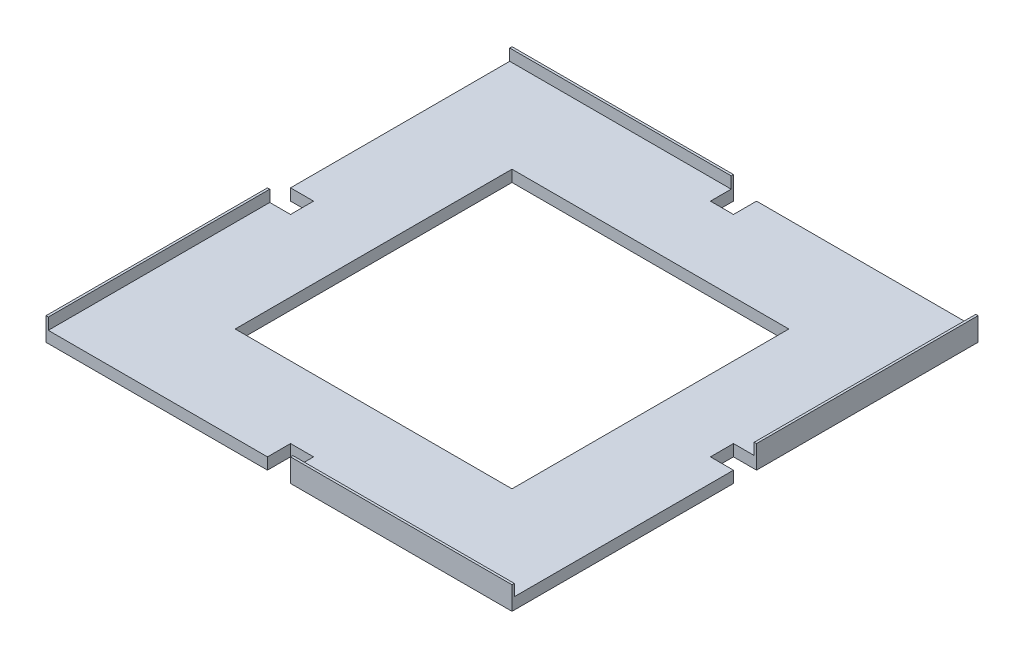
ISO-10303-21;
HEADER;
FILE_DESCRIPTION(('STEP AP214'),'2;1');
FILE_NAME('part.step','',(''),(''),'','','');
FILE_SCHEMA(('AUTOMOTIVE_DESIGN { 1 0 10303 214 1 1 1 1 }'));
ENDSEC;
DATA;
#1=APPLICATION_CONTEXT('core data for automotive mechanical design processes');
#2=APPLICATION_PROTOCOL_DEFINITION('international standard','automotive_design',2000,#1);
#3=PRODUCT_CONTEXT('',#1,'mechanical');
#4=PRODUCT('Part','Part','',(#3));
#5=PRODUCT_RELATED_PRODUCT_CATEGORY('part','',(#4));
#6=PRODUCT_DEFINITION_FORMATION('','',#4);
#7=PRODUCT_DEFINITION_CONTEXT('part definition',#1,'design');
#8=PRODUCT_DEFINITION('design','',#6,#7);
#9=PRODUCT_DEFINITION_SHAPE('','',#8);
#10=(LENGTH_UNIT() NAMED_UNIT(*) SI_UNIT(.MILLI.,.METRE.));
#11=(NAMED_UNIT(*) PLANE_ANGLE_UNIT() SI_UNIT($,.RADIAN.));
#12=(NAMED_UNIT(*) SI_UNIT($,.STERADIAN.) SOLID_ANGLE_UNIT());
#13=UNCERTAINTY_MEASURE_WITH_UNIT(LENGTH_MEASURE(1.E-05),#10,'distance_accuracy_value','');
#14=(GEOMETRIC_REPRESENTATION_CONTEXT(3) GLOBAL_UNCERTAINTY_ASSIGNED_CONTEXT((#13)) GLOBAL_UNIT_ASSIGNED_CONTEXT((#10,
#11,#12)) REPRESENTATION_CONTEXT('',''));
#15=CARTESIAN_POINT('',(0.,0.,0.));
#16=DIRECTION('',(0.,0.,1.));
#17=DIRECTION('',(1.,0.,0.));
#18=AXIS2_PLACEMENT_3D('',#15,#16,#17);
#19=CARTESIAN_POINT('',(0.,5.,0.));
#20=DIRECTION('',(0.,-1.,0.));
#21=DIRECTION('',(0.,0.,-1.));
#22=AXIS2_PLACEMENT_3D('',#19,#20,#21);
#23=PLANE('',#22);
#24=DIRECTION('',(0.,0.,-1.));
#25=VECTOR('',#24,1.);
#26=CARTESIAN_POINT('',(60.,5.,60.));
#27=LINE('',#26,#25);
#28=CARTESIAN_POINT('',(60.,5.,60.));
#29=VERTEX_POINT('',#28);
#30=CARTESIAN_POINT('',(60.,5.,-60.));
#31=VERTEX_POINT('',#30);
#32=EDGE_CURVE('E369',#29,#31,#27,.T.);
#33=ORIENTED_EDGE('',*,*,#32,.F.);
#34=DIRECTION('',(1.,0.,0.));
#35=VECTOR('',#34,1.);
#36=CARTESIAN_POINT('',(-60.,5.,60.));
#37=LINE('',#36,#35);
#38=CARTESIAN_POINT('',(-60.,5.,60.));
#39=VERTEX_POINT('',#38);
#40=EDGE_CURVE('E380',#39,#29,#37,.T.);
#41=ORIENTED_EDGE('',*,*,#40,.F.);
#42=DIRECTION('',(0.,0.,1.));
#43=VECTOR('',#42,1.);
#44=CARTESIAN_POINT('',(-60.,5.,60.));
#45=LINE('',#44,#43);
#46=CARTESIAN_POINT('',(-60.,5.,-60.));
#47=VERTEX_POINT('',#46);
#48=EDGE_CURVE('E376',#47,#39,#45,.T.);
#49=ORIENTED_EDGE('',*,*,#48,.F.);
#50=DIRECTION('',(-1.,0.,0.));
#51=VECTOR('',#50,1.);
#52=CARTESIAN_POINT('',(-60.,5.,-60.));
#53=LINE('',#52,#51);
#54=EDGE_CURVE('E372',#31,#47,#53,.T.);
#55=ORIENTED_EDGE('',*,*,#54,.F.);
#56=EDGE_LOOP('',(#33,#41,#49,#55));
#57=FACE_BOUND('',#56,.T.);
#58=DIRECTION('',(0.,0.,1.));
#59=VECTOR('',#58,1.);
#60=CARTESIAN_POINT('',(100.,5.,-4.99999999999894));
#61=LINE('',#60,#59);
#62=CARTESIAN_POINT('',(100.000000000001,5.,-100.999999999999));
#63=VERTEX_POINT('',#62);
#64=CARTESIAN_POINT('',(100.,5.,-5.));
#65=VERTEX_POINT('',#64);
#66=EDGE_CURVE('E265',#63,#65,#61,.T.);
#67=ORIENTED_EDGE('',*,*,#66,.F.);
#68=DIRECTION('',(-1.,0.,0.));
#69=VECTOR('',#68,1.);
#70=CARTESIAN_POINT('',(101.,5.,-101.));
#71=LINE('',#70,#69);
#72=CARTESIAN_POINT('',(5.00000000000002,5.,-101.));
#73=VERTEX_POINT('',#72);
#74=EDGE_CURVE('E253',#63,#73,#71,.T.);
#75=ORIENTED_EDGE('',*,*,#74,.T.);
#76=DIRECTION('',(0.,0.,1.));
#77=VECTOR('',#76,1.);
#78=CARTESIAN_POINT('',(5.00000000000002,5.,-101.));
#79=LINE('',#78,#77);
#80=CARTESIAN_POINT('',(5.00000000000001,5.,-91.));
#81=VERTEX_POINT('',#80);
#82=EDGE_CURVE('E263',#73,#81,#79,.T.);
#83=ORIENTED_EDGE('',*,*,#82,.T.);
#84=DIRECTION('',(-1.,0.,0.));
#85=VECTOR('',#84,1.);
#86=CARTESIAN_POINT('',(-5.,5.,-91.));
#87=LINE('',#86,#85);
#88=CARTESIAN_POINT('',(-5.,5.,-91.));
#89=VERTEX_POINT('',#88);
#90=EDGE_CURVE('E450',#81,#89,#87,.T.);
#91=ORIENTED_EDGE('',*,*,#90,.T.);
#92=DIRECTION('',(0.,0.,-1.));
#93=VECTOR('',#92,1.);
#94=CARTESIAN_POINT('',(-4.99999999999999,5.,-101.));
#95=LINE('',#94,#93);
#96=CARTESIAN_POINT('',(-4.99999999999999,5.,-100.));
#97=VERTEX_POINT('',#96);
#98=EDGE_CURVE('E453',#89,#97,#95,.T.);
#99=ORIENTED_EDGE('',*,*,#98,.T.);
#100=DIRECTION('',(1.,0.,0.));
#101=VECTOR('',#100,1.);
#102=CARTESIAN_POINT('',(-4.99999999999929,5.,-100.));
#103=LINE('',#102,#101);
#104=CARTESIAN_POINT('',(-101.,5.,-100.));
#105=VERTEX_POINT('',#104);
#106=EDGE_CURVE('E66',#105,#97,#103,.T.);
#107=ORIENTED_EDGE('',*,*,#106,.F.);
#108=DIRECTION('',(0.,0.,1.));
#109=VECTOR('',#108,1.);
#110=CARTESIAN_POINT('',(-101.,5.,-5.));
#111=LINE('',#110,#109);
#112=CARTESIAN_POINT('',(-101.,5.,-5.));
#113=VERTEX_POINT('',#112);
#114=EDGE_CURVE('E412',#105,#113,#111,.T.);
#115=ORIENTED_EDGE('',*,*,#114,.T.);
#116=DIRECTION('',(1.,0.,0.));
#117=VECTOR('',#116,1.);
#118=CARTESIAN_POINT('',(-101.,5.,-5.));
#119=LINE('',#118,#117);
#120=CARTESIAN_POINT('',(-90.9999999999999,5.,-5.00000000000001));
#121=VERTEX_POINT('',#120);
#122=EDGE_CURVE('E415',#113,#121,#119,.T.);
#123=ORIENTED_EDGE('',*,*,#122,.T.);
#124=DIRECTION('',(0.,0.,1.));
#125=VECTOR('',#124,1.);
#126=CARTESIAN_POINT('',(-91.,5.,5.00000000000001));
#127=LINE('',#126,#125);
#128=CARTESIAN_POINT('',(-91.,5.,5.00000000000001));
#129=VERTEX_POINT('',#128);
#130=EDGE_CURVE('E419',#121,#129,#127,.T.);
#131=ORIENTED_EDGE('',*,*,#130,.T.);
#132=DIRECTION('',(-1.,0.,0.));
#133=VECTOR('',#132,1.);
#134=CARTESIAN_POINT('',(-101.,5.,5.));
#135=LINE('',#134,#133);
#136=CARTESIAN_POINT('',(-100.,5.,5.));
#137=VERTEX_POINT('',#136);
#138=EDGE_CURVE('E422',#129,#137,#135,.T.);
#139=ORIENTED_EDGE('',*,*,#138,.T.);
#140=DIRECTION('',(0.,0.,-1.));
#141=VECTOR('',#140,1.);
#142=CARTESIAN_POINT('',(-100.,5.,4.99999999999964));
#143=LINE('',#142,#141);
#144=CARTESIAN_POINT('',(-100.,5.,101.));
#145=VERTEX_POINT('',#144);
#146=EDGE_CURVE('E325',#145,#137,#143,.T.);
#147=ORIENTED_EDGE('',*,*,#146,.F.);
#148=DIRECTION('',(1.,0.,0.));
#149=VECTOR('',#148,1.);
#150=CARTESIAN_POINT('',(-5.00000000000001,5.,101.));
#151=LINE('',#150,#149);
#152=CARTESIAN_POINT('',(-5.00000000000001,5.,101.));
#153=VERTEX_POINT('',#152);
#154=EDGE_CURVE('E425',#145,#153,#151,.T.);
#155=ORIENTED_EDGE('',*,*,#154,.T.);
#156=DIRECTION('',(0.,0.,-1.));
#157=VECTOR('',#156,1.);
#158=CARTESIAN_POINT('',(-5.00000000000001,5.,101.));
#159=LINE('',#158,#157);
#160=CARTESIAN_POINT('',(-4.99999999999998,5.,91.));
#161=VERTEX_POINT('',#160);
#162=EDGE_CURVE('E428',#153,#161,#159,.T.);
#163=ORIENTED_EDGE('',*,*,#162,.T.);
#164=DIRECTION('',(1.,0.,0.));
#165=VECTOR('',#164,1.);
#166=CARTESIAN_POINT('',(5.00000000000003,5.,91.));
#167=LINE('',#166,#165);
#168=CARTESIAN_POINT('',(5.00000000000003,5.,91.));
#169=VERTEX_POINT('',#168);
#170=EDGE_CURVE('E431',#161,#169,#167,.T.);
#171=ORIENTED_EDGE('',*,*,#170,.T.);
#172=DIRECTION('',(0.,0.,1.));
#173=VECTOR('',#172,1.);
#174=CARTESIAN_POINT('',(4.99999999999999,5.,101.));
#175=LINE('',#174,#173);
#176=CARTESIAN_POINT('',(4.99999999999999,5.,100.));
#177=VERTEX_POINT('',#176);
#178=EDGE_CURVE('E434',#169,#177,#175,.T.);
#179=ORIENTED_EDGE('',*,*,#178,.T.);
#180=DIRECTION('',(-1.,0.,0.));
#181=VECTOR('',#180,1.);
#182=CARTESIAN_POINT('',(4.99999999999999,5.,100.));
#183=LINE('',#182,#181);
#184=CARTESIAN_POINT('',(101.,5.,100.));
#185=VERTEX_POINT('',#184);
#186=EDGE_CURVE('E329',#185,#177,#183,.T.);
#187=ORIENTED_EDGE('',*,*,#186,.F.);
#188=DIRECTION('',(0.,0.,-1.));
#189=VECTOR('',#188,1.);
#190=CARTESIAN_POINT('',(101.,5.,101.));
#191=LINE('',#190,#189);
#192=CARTESIAN_POINT('',(101.,5.,5.));
#193=VERTEX_POINT('',#192);
#194=EDGE_CURVE('E437',#185,#193,#191,.T.);
#195=ORIENTED_EDGE('',*,*,#194,.T.);
#196=DIRECTION('',(-1.,0.,0.));
#197=VECTOR('',#196,1.);
#198=CARTESIAN_POINT('',(101.,5.,5.));
#199=LINE('',#198,#197);
#200=CARTESIAN_POINT('',(91.,5.,5.00000000000001));
#201=VERTEX_POINT('',#200);
#202=EDGE_CURVE('E440',#193,#201,#199,.T.);
#203=ORIENTED_EDGE('',*,*,#202,.T.);
#204=DIRECTION('',(0.,0.,-1.));
#205=VECTOR('',#204,1.);
#206=CARTESIAN_POINT('',(91.,5.,-4.99999999999999));
#207=LINE('',#206,#205);
#208=CARTESIAN_POINT('',(91.,5.,-4.99999999999999));
#209=VERTEX_POINT('',#208);
#210=EDGE_CURVE('E443',#201,#209,#207,.T.);
#211=ORIENTED_EDGE('',*,*,#210,.T.);
#212=DIRECTION('',(1.,0.,0.));
#213=VECTOR('',#212,1.);
#214=CARTESIAN_POINT('',(101.,5.,-5.));
#215=LINE('',#214,#213);
#216=EDGE_CURVE('E59',#209,#65,#215,.T.);
#217=ORIENTED_EDGE('',*,*,#216,.T.);
#218=EDGE_LOOP('',(#67,#75,#83,#91,#99,#107,#115,#123,#131,#139,#147,#155,#163,#171,#179,#187,
#195,#203,#211,#217));
#219=FACE_BOUND('',#218,.T.);
#220=ADVANCED_FACE('F43',(#57,#219),#23,.F.);
#221=CARTESIAN_POINT('',(0.,0.,0.));
#222=DIRECTION('',(0.,-1.,0.));
#223=DIRECTION('',(0.,0.,-1.));
#224=AXIS2_PLACEMENT_3D('',#221,#222,#223);
#225=PLANE('',#224);
#226=DIRECTION('',(-1.,0.,0.));
#227=VECTOR('',#226,1.);
#228=CARTESIAN_POINT('',(-4.99999999999999,0.,-101.));
#229=LINE('',#228,#227);
#230=CARTESIAN_POINT('',(-4.99999999999999,0.,-101.));
#231=VERTEX_POINT('',#230);
#232=CARTESIAN_POINT('',(-101.,0.,-101.));
#233=VERTEX_POINT('',#232);
#234=EDGE_CURVE('E411',#231,#233,#229,.T.);
#235=ORIENTED_EDGE('',*,*,#234,.F.);
#236=DIRECTION('',(0.,0.,-1.));
#237=VECTOR('',#236,1.);
#238=CARTESIAN_POINT('',(-4.99999999999999,0.,-101.));
#239=LINE('',#238,#237);
#240=CARTESIAN_POINT('',(-5.,0.,-91.));
#241=VERTEX_POINT('',#240);
#242=EDGE_CURVE('E416',#241,#231,#239,.T.);
#243=ORIENTED_EDGE('',*,*,#242,.F.);
#244=DIRECTION('',(-1.,0.,0.));
#245=VECTOR('',#244,1.);
#246=CARTESIAN_POINT('',(-5.,0.,-91.));
#247=LINE('',#246,#245);
#248=CARTESIAN_POINT('',(5.00000000000001,0.,-91.));
#249=VERTEX_POINT('',#248);
#250=EDGE_CURVE('E511',#249,#241,#247,.T.);
#251=ORIENTED_EDGE('',*,*,#250,.F.);
#252=DIRECTION('',(0.,0.,1.));
#253=VECTOR('',#252,1.);
#254=CARTESIAN_POINT('',(5.00000000000002,0.,-101.));
#255=LINE('',#254,#253);
#256=CARTESIAN_POINT('',(5.00000000000002,0.,-101.));
#257=VERTEX_POINT('',#256);
#258=EDGE_CURVE('E508',#257,#249,#255,.T.);
#259=ORIENTED_EDGE('',*,*,#258,.F.);
#260=DIRECTION('',(-1.,0.,0.));
#261=VECTOR('',#260,1.);
#262=CARTESIAN_POINT('',(101.,0.,-101.));
#263=LINE('',#262,#261);
#264=CARTESIAN_POINT('',(101.,0.,-101.));
#265=VERTEX_POINT('',#264);
#266=EDGE_CURVE('E505',#265,#257,#263,.T.);
#267=ORIENTED_EDGE('',*,*,#266,.F.);
#268=DIRECTION('',(0.,0.,-1.));
#269=VECTOR('',#268,1.);
#270=CARTESIAN_POINT('',(101.,0.,-5.));
#271=LINE('',#270,#269);
#272=CARTESIAN_POINT('',(101.,0.,-5.));
#273=VERTEX_POINT('',#272);
#274=EDGE_CURVE('E502',#273,#265,#271,.T.);
#275=ORIENTED_EDGE('',*,*,#274,.F.);
#276=DIRECTION('',(1.,0.,0.));
#277=VECTOR('',#276,1.);
#278=CARTESIAN_POINT('',(101.,0.,-5.));
#279=LINE('',#278,#277);
#280=CARTESIAN_POINT('',(91.,0.,-4.99999999999999));
#281=VERTEX_POINT('',#280);
#282=EDGE_CURVE('E499',#281,#273,#279,.T.);
#283=ORIENTED_EDGE('',*,*,#282,.F.);
#284=DIRECTION('',(0.,0.,-1.));
#285=VECTOR('',#284,1.);
#286=CARTESIAN_POINT('',(91.,0.,-4.99999999999999));
#287=LINE('',#286,#285);
#288=CARTESIAN_POINT('',(91.,0.,5.00000000000001));
#289=VERTEX_POINT('',#288);
#290=EDGE_CURVE('E496',#289,#281,#287,.T.);
#291=ORIENTED_EDGE('',*,*,#290,.F.);
#292=DIRECTION('',(-1.,0.,0.));
#293=VECTOR('',#292,1.);
#294=CARTESIAN_POINT('',(101.,0.,5.));
#295=LINE('',#294,#293);
#296=CARTESIAN_POINT('',(101.,0.,5.));
#297=VERTEX_POINT('',#296);
#298=EDGE_CURVE('E493',#297,#289,#295,.T.);
#299=ORIENTED_EDGE('',*,*,#298,.F.);
#300=DIRECTION('',(0.,0.,-1.));
#301=VECTOR('',#300,1.);
#302=CARTESIAN_POINT('',(101.,0.,101.));
#303=LINE('',#302,#301);
#304=CARTESIAN_POINT('',(101.,0.,101.));
#305=VERTEX_POINT('',#304);
#306=EDGE_CURVE('E490',#305,#297,#303,.T.);
#307=ORIENTED_EDGE('',*,*,#306,.F.);
#308=DIRECTION('',(1.,0.,0.));
#309=VECTOR('',#308,1.);
#310=CARTESIAN_POINT('',(101.,0.,101.));
#311=LINE('',#310,#309);
#312=CARTESIAN_POINT('',(4.99999999999999,0.,101.));
#313=VERTEX_POINT('',#312);
#314=EDGE_CURVE('E487',#313,#305,#311,.T.);
#315=ORIENTED_EDGE('',*,*,#314,.F.);
#316=DIRECTION('',(0.,0.,1.));
#317=VECTOR('',#316,1.);
#318=CARTESIAN_POINT('',(4.99999999999999,0.,101.));
#319=LINE('',#318,#317);
#320=CARTESIAN_POINT('',(5.00000000000003,0.,91.));
#321=VERTEX_POINT('',#320);
#322=EDGE_CURVE('E484',#321,#313,#319,.T.);
#323=ORIENTED_EDGE('',*,*,#322,.F.);
#324=DIRECTION('',(1.,0.,0.));
#325=VECTOR('',#324,1.);
#326=CARTESIAN_POINT('',(5.00000000000003,0.,91.));
#327=LINE('',#326,#325);
#328=CARTESIAN_POINT('',(-4.99999999999998,0.,91.));
#329=VERTEX_POINT('',#328);
#330=EDGE_CURVE('E481',#329,#321,#327,.T.);
#331=ORIENTED_EDGE('',*,*,#330,.F.);
#332=DIRECTION('',(0.,0.,-1.));
#333=VECTOR('',#332,1.);
#334=CARTESIAN_POINT('',(-5.00000000000001,0.,101.));
#335=LINE('',#334,#333);
#336=CARTESIAN_POINT('',(-5.00000000000001,0.,101.));
#337=VERTEX_POINT('',#336);
#338=EDGE_CURVE('E478',#337,#329,#335,.T.);
#339=ORIENTED_EDGE('',*,*,#338,.F.);
#340=DIRECTION('',(1.,0.,0.));
#341=VECTOR('',#340,1.);
#342=CARTESIAN_POINT('',(-5.00000000000001,0.,101.));
#343=LINE('',#342,#341);
#344=CARTESIAN_POINT('',(-101.,0.,101.));
#345=VERTEX_POINT('',#344);
#346=EDGE_CURVE('E475',#345,#337,#343,.T.);
#347=ORIENTED_EDGE('',*,*,#346,.F.);
#348=DIRECTION('',(0.,0.,1.));
#349=VECTOR('',#348,1.);
#350=CARTESIAN_POINT('',(-101.,0.,101.));
#351=LINE('',#350,#349);
#352=CARTESIAN_POINT('',(-101.,0.,5.));
#353=VERTEX_POINT('',#352);
#354=EDGE_CURVE('E472',#353,#345,#351,.T.);
#355=ORIENTED_EDGE('',*,*,#354,.F.);
#356=DIRECTION('',(-1.,0.,0.));
#357=VECTOR('',#356,1.);
#358=CARTESIAN_POINT('',(-101.,0.,5.));
#359=LINE('',#358,#357);
#360=CARTESIAN_POINT('',(-91.,0.,5.00000000000001));
#361=VERTEX_POINT('',#360);
#362=EDGE_CURVE('E469',#361,#353,#359,.T.);
#363=ORIENTED_EDGE('',*,*,#362,.F.);
#364=DIRECTION('',(0.,0.,1.));
#365=VECTOR('',#364,1.);
#366=CARTESIAN_POINT('',(-91.,0.,5.00000000000001));
#367=LINE('',#366,#365);
#368=CARTESIAN_POINT('',(-90.9999999999999,0.,-5.00000000000001));
#369=VERTEX_POINT('',#368);
#370=EDGE_CURVE('E466',#369,#361,#367,.T.);
#371=ORIENTED_EDGE('',*,*,#370,.F.);
#372=DIRECTION('',(1.,0.,0.));
#373=VECTOR('',#372,1.);
#374=CARTESIAN_POINT('',(-101.,0.,-5.));
#375=LINE('',#374,#373);
#376=CARTESIAN_POINT('',(-101.,0.,-5.));
#377=VERTEX_POINT('',#376);
#378=EDGE_CURVE('E463',#377,#369,#375,.T.);
#379=ORIENTED_EDGE('',*,*,#378,.F.);
#380=DIRECTION('',(0.,0.,1.));
#381=VECTOR('',#380,1.);
#382=CARTESIAN_POINT('',(-101.,0.,-5.));
#383=LINE('',#382,#381);
#384=EDGE_CURVE('E460',#233,#377,#383,.T.);
#385=ORIENTED_EDGE('',*,*,#384,.F.);
#386=EDGE_LOOP('',(#235,#243,#251,#259,#267,#275,#283,#291,#299,#307,#315,#323,#331,#339,#347,
#355,#363,#371,#379,#385));
#387=FACE_BOUND('',#386,.T.);
#388=DIRECTION('',(1.,0.,0.));
#389=VECTOR('',#388,1.);
#390=CARTESIAN_POINT('',(-60.,0.,60.));
#391=LINE('',#390,#389);
#392=CARTESIAN_POINT('',(-60.,0.,60.));
#393=VERTEX_POINT('',#392);
#394=CARTESIAN_POINT('',(60.,0.,60.));
#395=VERTEX_POINT('',#394);
#396=EDGE_CURVE('E373',#393,#395,#391,.T.);
#397=ORIENTED_EDGE('',*,*,#396,.T.);
#398=DIRECTION('',(0.,0.,-1.));
#399=VECTOR('',#398,1.);
#400=CARTESIAN_POINT('',(60.,0.,60.));
#401=LINE('',#400,#399);
#402=CARTESIAN_POINT('',(60.,0.,-60.));
#403=VERTEX_POINT('',#402);
#404=EDGE_CURVE('E368',#395,#403,#401,.T.);
#405=ORIENTED_EDGE('',*,*,#404,.T.);
#406=DIRECTION('',(-1.,0.,0.));
#407=VECTOR('',#406,1.);
#408=CARTESIAN_POINT('',(-60.,0.,-60.));
#409=LINE('',#408,#407);
#410=CARTESIAN_POINT('',(-60.,0.,-60.));
#411=VERTEX_POINT('',#410);
#412=EDGE_CURVE('E387',#403,#411,#409,.T.);
#413=ORIENTED_EDGE('',*,*,#412,.T.);
#414=DIRECTION('',(0.,0.,1.));
#415=VECTOR('',#414,1.);
#416=CARTESIAN_POINT('',(-60.,0.,60.));
#417=LINE('',#416,#415);
#418=EDGE_CURVE('E391',#411,#393,#417,.T.);
#419=ORIENTED_EDGE('',*,*,#418,.T.);
#420=EDGE_LOOP('',(#397,#405,#413,#419));
#421=FACE_BOUND('',#420,.T.);
#422=ADVANCED_FACE('F596',(#387,#421),#225,.T.);
#423=CARTESIAN_POINT('',(-4.99999999999999,5.,-101.));
#424=DIRECTION('',(0.,0.,1.));
#425=DIRECTION('',(1.,0.,0.));
#426=AXIS2_PLACEMENT_3D('',#423,#424,#425);
#427=PLANE('',#426);
#428=ORIENTED_EDGE('',*,*,#234,.T.);
#429=DIRECTION('',(0.,-1.,0.));
#430=VECTOR('',#429,1.);
#431=CARTESIAN_POINT('',(-101.,5.,-101.));
#432=LINE('',#431,#430);
#433=CARTESIAN_POINT('',(-100.999999999999,10.,-101.000000000001));
#434=VERTEX_POINT('',#433);
#435=EDGE_CURVE('E11',#434,#233,#432,.T.);
#436=ORIENTED_EDGE('',*,*,#435,.F.);
#437=DIRECTION('',(-1.,0.,0.));
#438=VECTOR('',#437,1.);
#439=CARTESIAN_POINT('',(-4.99999999999929,10.,-101.));
#440=LINE('',#439,#438);
#441=CARTESIAN_POINT('',(-4.99999999999929,10.,-101.));
#442=VERTEX_POINT('',#441);
#443=EDGE_CURVE('E304',#442,#434,#440,.T.);
#444=ORIENTED_EDGE('',*,*,#443,.F.);
#445=DIRECTION('',(0.,-1.,0.));
#446=VECTOR('',#445,1.);
#447=CARTESIAN_POINT('',(-4.99999999999999,5.,-101.));
#448=LINE('',#447,#446);
#449=EDGE_CURVE('E456',#442,#231,#448,.T.);
#450=ORIENTED_EDGE('',*,*,#449,.T.);
#451=EDGE_LOOP('',(#428,#436,#444,#450));
#452=FACE_BOUND('',#451,.T.);
#453=ADVANCED_FACE('F45',(#452),#427,.F.);
#454=CARTESIAN_POINT('',(-101.,5.,-5.));
#455=DIRECTION('',(1.,0.,0.));
#456=DIRECTION('',(0.,0.,-1.));
#457=AXIS2_PLACEMENT_3D('',#454,#455,#456);
#458=PLANE('',#457);
#459=ORIENTED_EDGE('',*,*,#384,.T.);
#460=DIRECTION('',(0.,-1.,0.));
#461=VECTOR('',#460,1.);
#462=CARTESIAN_POINT('',(-101.,5.,-5.));
#463=LINE('',#462,#461);
#464=EDGE_CURVE('E52',#113,#377,#463,.T.);
#465=ORIENTED_EDGE('',*,*,#464,.F.);
#466=ORIENTED_EDGE('',*,*,#114,.F.);
#467=DIRECTION('',(0.,-1.,0.));
#468=VECTOR('',#467,1.);
#469=CARTESIAN_POINT('',(-100.999999999999,10.,-100.000000000001));
#470=LINE('',#469,#468);
#471=CARTESIAN_POINT('',(-100.999999999999,10.,-100.000000000001));
#472=VERTEX_POINT('',#471);
#473=EDGE_CURVE('E270',#472,#105,#470,.T.);
#474=ORIENTED_EDGE('',*,*,#473,.F.);
#475=DIRECTION('',(0.,0.,1.));
#476=VECTOR('',#475,1.);
#477=CARTESIAN_POINT('',(-100.999999999999,10.,-101.000000000001));
#478=LINE('',#477,#476);
#479=EDGE_CURVE('E311',#434,#472,#478,.T.);
#480=ORIENTED_EDGE('',*,*,#479,.F.);
#481=ORIENTED_EDGE('',*,*,#435,.T.);
#482=EDGE_LOOP('',(#459,#465,#466,#474,#480,#481));
#483=FACE_BOUND('',#482,.T.);
#484=ADVANCED_FACE('F688',(#483),#458,.F.);
#485=CARTESIAN_POINT('',(-101.,5.,-5.));
#486=DIRECTION('',(0.,0.,-1.));
#487=DIRECTION('',(-1.,0.,0.));
#488=AXIS2_PLACEMENT_3D('',#485,#486,#487);
#489=PLANE('',#488);
#490=ORIENTED_EDGE('',*,*,#378,.T.);
#491=DIRECTION('',(0.,-1.,0.));
#492=VECTOR('',#491,1.);
#493=CARTESIAN_POINT('',(-90.9999999999999,5.,-5.00000000000001));
#494=LINE('',#493,#492);
#495=EDGE_CURVE('E581',#121,#369,#494,.T.);
#496=ORIENTED_EDGE('',*,*,#495,.F.);
#497=ORIENTED_EDGE('',*,*,#122,.F.);
#498=ORIENTED_EDGE('',*,*,#464,.T.);
#499=EDGE_LOOP('',(#490,#496,#497,#498));
#500=FACE_BOUND('',#499,.T.);
#501=ADVANCED_FACE('F590',(#500),#489,.F.);
#502=CARTESIAN_POINT('',(-91.,5.,5.00000000000001));
#503=DIRECTION('',(1.,0.,0.));
#504=DIRECTION('',(0.,0.,-1.));
#505=AXIS2_PLACEMENT_3D('',#502,#503,#504);
#506=PLANE('',#505);
#507=ORIENTED_EDGE('',*,*,#370,.T.);
#508=DIRECTION('',(0.,-1.,0.));
#509=VECTOR('',#508,1.);
#510=CARTESIAN_POINT('',(-91.,5.,5.00000000000001));
#511=LINE('',#510,#509);
#512=EDGE_CURVE('E577',#129,#361,#511,.T.);
#513=ORIENTED_EDGE('',*,*,#512,.F.);
#514=ORIENTED_EDGE('',*,*,#130,.F.);
#515=ORIENTED_EDGE('',*,*,#495,.T.);
#516=EDGE_LOOP('',(#507,#513,#514,#515));
#517=FACE_BOUND('',#516,.T.);
#518=ADVANCED_FACE('F602',(#517),#506,.F.);
#519=CARTESIAN_POINT('',(-101.,5.,5.));
#520=DIRECTION('',(0.,0.,1.));
#521=DIRECTION('',(1.,0.,0.));
#522=AXIS2_PLACEMENT_3D('',#519,#520,#521);
#523=PLANE('',#522);
#524=ORIENTED_EDGE('',*,*,#362,.T.);
#525=DIRECTION('',(0.,-1.,0.));
#526=VECTOR('',#525,1.);
#527=CARTESIAN_POINT('',(-101.,5.,5.));
#528=LINE('',#527,#526);
#529=CARTESIAN_POINT('',(-101.,10.,4.99999999999964));
#530=VERTEX_POINT('',#529);
#531=EDGE_CURVE('E573',#530,#353,#528,.T.);
#532=ORIENTED_EDGE('',*,*,#531,.F.);
#533=DIRECTION('',(-1.,0.,0.));
#534=VECTOR('',#533,1.);
#535=CARTESIAN_POINT('',(-101.,10.,4.99999999999964));
#536=LINE('',#535,#534);
#537=CARTESIAN_POINT('',(-100.,10.,4.99999999999964));
#538=VERTEX_POINT('',#537);
#539=EDGE_CURVE('E324',#538,#530,#536,.T.);
#540=ORIENTED_EDGE('',*,*,#539,.F.);
#541=DIRECTION('',(0.,-1.,0.));
#542=VECTOR('',#541,1.);
#543=CARTESIAN_POINT('',(-100.,10.,4.99999999999964));
#544=LINE('',#543,#542);
#545=EDGE_CURVE('E320',#538,#137,#544,.T.);
#546=ORIENTED_EDGE('',*,*,#545,.T.);
#547=ORIENTED_EDGE('',*,*,#138,.F.);
#548=ORIENTED_EDGE('',*,*,#512,.T.);
#549=EDGE_LOOP('',(#524,#532,#540,#546,#547,#548));
#550=FACE_BOUND('',#549,.T.);
#551=ADVANCED_FACE('F606',(#550),#523,.F.);
#552=CARTESIAN_POINT('',(-101.,5.,101.));
#553=DIRECTION('',(1.,0.,0.));
#554=DIRECTION('',(0.,0.,-1.));
#555=AXIS2_PLACEMENT_3D('',#552,#553,#554);
#556=PLANE('',#555);
#557=ORIENTED_EDGE('',*,*,#354,.T.);
#558=DIRECTION('',(0.,-1.,0.));
#559=VECTOR('',#558,1.);
#560=CARTESIAN_POINT('',(-101.,5.,101.));
#561=LINE('',#560,#559);
#562=CARTESIAN_POINT('',(-101.,10.,101.));
#563=VERTEX_POINT('',#562);
#564=EDGE_CURVE('E569',#563,#345,#561,.T.);
#565=ORIENTED_EDGE('',*,*,#564,.F.);
#566=DIRECTION('',(0.,0.,1.));
#567=VECTOR('',#566,1.);
#568=CARTESIAN_POINT('',(-101.,10.,4.99999999999964));
#569=LINE('',#568,#567);
#570=EDGE_CURVE('E330',#530,#563,#569,.T.);
#571=ORIENTED_EDGE('',*,*,#570,.F.);
#572=ORIENTED_EDGE('',*,*,#531,.T.);
#573=EDGE_LOOP('',(#557,#565,#571,#572));
#574=FACE_BOUND('',#573,.T.);
#575=ADVANCED_FACE('F737',(#574),#556,.F.);
#576=CARTESIAN_POINT('',(-5.00000000000001,5.,101.));
#577=DIRECTION('',(0.,0.,-1.));
#578=DIRECTION('',(-1.,0.,0.));
#579=AXIS2_PLACEMENT_3D('',#576,#577,#578);
#580=PLANE('',#579);
#581=ORIENTED_EDGE('',*,*,#346,.T.);
#582=DIRECTION('',(0.,-1.,0.));
#583=VECTOR('',#582,1.);
#584=CARTESIAN_POINT('',(-5.00000000000001,5.,101.));
#585=LINE('',#584,#583);
#586=EDGE_CURVE('E565',#153,#337,#585,.T.);
#587=ORIENTED_EDGE('',*,*,#586,.F.);
#588=ORIENTED_EDGE('',*,*,#154,.F.);
#589=DIRECTION('',(0.,-1.,0.));
#590=VECTOR('',#589,1.);
#591=CARTESIAN_POINT('',(-100.,10.,101.));
#592=LINE('',#591,#590);
#593=CARTESIAN_POINT('',(-100.,10.,101.));
#594=VERTEX_POINT('',#593);
#595=EDGE_CURVE('E303',#594,#145,#592,.T.);
#596=ORIENTED_EDGE('',*,*,#595,.F.);
#597=DIRECTION('',(1.,0.,0.));
#598=VECTOR('',#597,1.);
#599=CARTESIAN_POINT('',(-101.,10.,101.));
#600=LINE('',#599,#598);
#601=EDGE_CURVE('E337',#563,#594,#600,.T.);
#602=ORIENTED_EDGE('',*,*,#601,.F.);
#603=ORIENTED_EDGE('',*,*,#564,.T.);
#604=EDGE_LOOP('',(#581,#587,#588,#596,#602,#603));
#605=FACE_BOUND('',#604,.T.);
#606=ADVANCED_FACE('F616',(#605),#580,.F.);
#607=CARTESIAN_POINT('',(-5.00000000000001,5.,101.));
#608=DIRECTION('',(-1.,0.,0.));
#609=DIRECTION('',(0.,0.,1.));
#610=AXIS2_PLACEMENT_3D('',#607,#608,#609);
#611=PLANE('',#610);
#612=ORIENTED_EDGE('',*,*,#338,.T.);
#613=DIRECTION('',(0.,-1.,0.));
#614=VECTOR('',#613,1.);
#615=CARTESIAN_POINT('',(-4.99999999999998,5.,91.));
#616=LINE('',#615,#614);
#617=EDGE_CURVE('E561',#161,#329,#616,.T.);
#618=ORIENTED_EDGE('',*,*,#617,.F.);
#619=ORIENTED_EDGE('',*,*,#162,.F.);
#620=ORIENTED_EDGE('',*,*,#586,.T.);
#621=EDGE_LOOP('',(#612,#618,#619,#620));
#622=FACE_BOUND('',#621,.T.);
#623=ADVANCED_FACE('F623',(#622),#611,.F.);
#624=CARTESIAN_POINT('',(5.00000000000003,5.,91.));
#625=DIRECTION('',(0.,0.,-1.));
#626=DIRECTION('',(-1.,0.,0.));
#627=AXIS2_PLACEMENT_3D('',#624,#625,#626);
#628=PLANE('',#627);
#629=ORIENTED_EDGE('',*,*,#330,.T.);
#630=DIRECTION('',(0.,-1.,0.));
#631=VECTOR('',#630,1.);
#632=CARTESIAN_POINT('',(5.00000000000003,5.,91.));
#633=LINE('',#632,#631);
#634=EDGE_CURVE('E557',#169,#321,#633,.T.);
#635=ORIENTED_EDGE('',*,*,#634,.F.);
#636=ORIENTED_EDGE('',*,*,#170,.F.);
#637=ORIENTED_EDGE('',*,*,#617,.T.);
#638=EDGE_LOOP('',(#629,#635,#636,#637));
#639=FACE_BOUND('',#638,.T.);
#640=ADVANCED_FACE('F627',(#639),#628,.F.);
#641=CARTESIAN_POINT('',(4.99999999999999,5.,101.));
#642=DIRECTION('',(1.,0.,0.));
#643=DIRECTION('',(0.,0.,-1.));
#644=AXIS2_PLACEMENT_3D('',#641,#642,#643);
#645=PLANE('',#644);
#646=ORIENTED_EDGE('',*,*,#322,.T.);
#647=DIRECTION('',(0.,-1.,0.));
#648=VECTOR('',#647,1.);
#649=CARTESIAN_POINT('',(4.99999999999999,5.,101.));
#650=LINE('',#649,#648);
#651=CARTESIAN_POINT('',(4.99999999999999,10.,101.));
#652=VERTEX_POINT('',#651);
#653=EDGE_CURVE('E553',#652,#313,#650,.T.);
#654=ORIENTED_EDGE('',*,*,#653,.F.);
#655=DIRECTION('',(0.,0.,1.));
#656=VECTOR('',#655,1.);
#657=CARTESIAN_POINT('',(4.99999999999999,10.,101.));
#658=LINE('',#657,#656);
#659=CARTESIAN_POINT('',(4.99999999999999,10.,100.));
#660=VERTEX_POINT('',#659);
#661=EDGE_CURVE('E343',#660,#652,#658,.T.);
#662=ORIENTED_EDGE('',*,*,#661,.F.);
#663=DIRECTION('',(0.,-1.,0.));
#664=VECTOR('',#663,1.);
#665=CARTESIAN_POINT('',(4.99999999999999,10.,100.));
#666=LINE('',#665,#664);
#667=EDGE_CURVE('E357',#660,#177,#666,.T.);
#668=ORIENTED_EDGE('',*,*,#667,.T.);
#669=ORIENTED_EDGE('',*,*,#178,.F.);
#670=ORIENTED_EDGE('',*,*,#634,.T.);
#671=EDGE_LOOP('',(#646,#654,#662,#668,#669,#670));
#672=FACE_BOUND('',#671,.T.);
#673=ADVANCED_FACE('F631',(#672),#645,.F.);
#674=CARTESIAN_POINT('',(101.,5.,101.));
#675=DIRECTION('',(0.,0.,-1.));
#676=DIRECTION('',(-1.,0.,0.));
#677=AXIS2_PLACEMENT_3D('',#674,#675,#676);
#678=PLANE('',#677);
#679=ORIENTED_EDGE('',*,*,#314,.T.);
#680=DIRECTION('',(0.,-1.,0.));
#681=VECTOR('',#680,1.);
#682=CARTESIAN_POINT('',(101.,5.,101.));
#683=LINE('',#682,#681);
#684=CARTESIAN_POINT('',(101.,10.,101.));
#685=VERTEX_POINT('',#684);
#686=EDGE_CURVE('E549',#685,#305,#683,.T.);
#687=ORIENTED_EDGE('',*,*,#686,.F.);
#688=DIRECTION('',(1.,0.,0.));
#689=VECTOR('',#688,1.);
#690=CARTESIAN_POINT('',(4.99999999999999,10.,101.));
#691=LINE('',#690,#689);
#692=EDGE_CURVE('E347',#652,#685,#691,.T.);
#693=ORIENTED_EDGE('',*,*,#692,.F.);
#694=ORIENTED_EDGE('',*,*,#653,.T.);
#695=EDGE_LOOP('',(#679,#687,#693,#694));
#696=FACE_BOUND('',#695,.T.);
#697=ADVANCED_FACE('F725',(#696),#678,.F.);
#698=CARTESIAN_POINT('',(101.,5.,101.));
#699=DIRECTION('',(-1.,0.,0.));
#700=DIRECTION('',(0.,0.,1.));
#701=AXIS2_PLACEMENT_3D('',#698,#699,#700);
#702=PLANE('',#701);
#703=ORIENTED_EDGE('',*,*,#306,.T.);
#704=DIRECTION('',(0.,-1.,0.));
#705=VECTOR('',#704,1.);
#706=CARTESIAN_POINT('',(101.,5.,5.));
#707=LINE('',#706,#705);
#708=EDGE_CURVE('E545',#193,#297,#707,.T.);
#709=ORIENTED_EDGE('',*,*,#708,.F.);
#710=ORIENTED_EDGE('',*,*,#194,.F.);
#711=DIRECTION('',(0.,-1.,0.));
#712=VECTOR('',#711,1.);
#713=CARTESIAN_POINT('',(101.,10.,100.));
#714=LINE('',#713,#712);
#715=CARTESIAN_POINT('',(101.,10.,100.));
#716=VERTEX_POINT('',#715);
#717=EDGE_CURVE('E364',#716,#185,#714,.T.);
#718=ORIENTED_EDGE('',*,*,#717,.F.);
#719=DIRECTION('',(0.,0.,-1.));
#720=VECTOR('',#719,1.);
#721=CARTESIAN_POINT('',(101.,10.,101.));
#722=LINE('',#721,#720);
#723=EDGE_CURVE('E351',#685,#716,#722,.T.);
#724=ORIENTED_EDGE('',*,*,#723,.F.);
#725=ORIENTED_EDGE('',*,*,#686,.T.);
#726=EDGE_LOOP('',(#703,#709,#710,#718,#724,#725));
#727=FACE_BOUND('',#726,.T.);
#728=ADVANCED_FACE('F641',(#727),#702,.F.);
#729=CARTESIAN_POINT('',(101.,5.,5.));
#730=DIRECTION('',(0.,0.,1.));
#731=DIRECTION('',(1.,0.,0.));
#732=AXIS2_PLACEMENT_3D('',#729,#730,#731);
#733=PLANE('',#732);
#734=ORIENTED_EDGE('',*,*,#298,.T.);
#735=DIRECTION('',(0.,-1.,0.));
#736=VECTOR('',#735,1.);
#737=CARTESIAN_POINT('',(91.,5.,5.00000000000001));
#738=LINE('',#737,#736);
#739=EDGE_CURVE('E541',#201,#289,#738,.T.);
#740=ORIENTED_EDGE('',*,*,#739,.F.);
#741=ORIENTED_EDGE('',*,*,#202,.F.);
#742=ORIENTED_EDGE('',*,*,#708,.T.);
#743=EDGE_LOOP('',(#734,#740,#741,#742));
#744=FACE_BOUND('',#743,.T.);
#745=ADVANCED_FACE('F648',(#744),#733,.F.);
#746=CARTESIAN_POINT('',(91.,5.,-4.99999999999999));
#747=DIRECTION('',(-1.,0.,0.));
#748=DIRECTION('',(0.,0.,1.));
#749=AXIS2_PLACEMENT_3D('',#746,#747,#748);
#750=PLANE('',#749);
#751=ORIENTED_EDGE('',*,*,#290,.T.);
#752=DIRECTION('',(0.,-1.,0.));
#753=VECTOR('',#752,1.);
#754=CARTESIAN_POINT('',(91.,5.,-4.99999999999999));
#755=LINE('',#754,#753);
#756=EDGE_CURVE('E537',#209,#281,#755,.T.);
#757=ORIENTED_EDGE('',*,*,#756,.F.);
#758=ORIENTED_EDGE('',*,*,#210,.F.);
#759=ORIENTED_EDGE('',*,*,#739,.T.);
#760=EDGE_LOOP('',(#751,#757,#758,#759));
#761=FACE_BOUND('',#760,.T.);
#762=ADVANCED_FACE('F652',(#761),#750,.F.);
#763=CARTESIAN_POINT('',(101.,5.,-5.));
#764=DIRECTION('',(0.,0.,-1.));
#765=DIRECTION('',(-1.,0.,0.));
#766=AXIS2_PLACEMENT_3D('',#763,#764,#765);
#767=PLANE('',#766);
#768=ORIENTED_EDGE('',*,*,#282,.T.);
#769=DIRECTION('',(0.,-1.,0.));
#770=VECTOR('',#769,1.);
#771=CARTESIAN_POINT('',(101.,5.,-5.));
#772=LINE('',#771,#770);
#773=CARTESIAN_POINT('',(101.,10.,-4.99999999999893));
#774=VERTEX_POINT('',#773);
#775=EDGE_CURVE('E533',#774,#273,#772,.T.);
#776=ORIENTED_EDGE('',*,*,#775,.F.);
#777=DIRECTION('',(1.,0.,0.));
#778=VECTOR('',#777,1.);
#779=CARTESIAN_POINT('',(101.,10.,-4.99999999999893));
#780=LINE('',#779,#778);
#781=CARTESIAN_POINT('',(100.,10.,-4.99999999999894));
#782=VERTEX_POINT('',#781);
#783=EDGE_CURVE('E279',#782,#774,#780,.T.);
#784=ORIENTED_EDGE('',*,*,#783,.F.);
#785=DIRECTION('',(0.,-1.,0.));
#786=VECTOR('',#785,1.);
#787=CARTESIAN_POINT('',(100.,10.,-4.99999999999894));
#788=LINE('',#787,#786);
#789=EDGE_CURVE('E276',#782,#65,#788,.T.);
#790=ORIENTED_EDGE('',*,*,#789,.T.);
#791=ORIENTED_EDGE('',*,*,#216,.F.);
#792=ORIENTED_EDGE('',*,*,#756,.T.);
#793=EDGE_LOOP('',(#768,#776,#784,#790,#791,#792));
#794=FACE_BOUND('',#793,.T.);
#795=ADVANCED_FACE('F655',(#794),#767,.F.);
#796=CARTESIAN_POINT('',(101.,5.,-5.));
#797=DIRECTION('',(-1.,0.,0.));
#798=DIRECTION('',(0.,0.,1.));
#799=AXIS2_PLACEMENT_3D('',#796,#797,#798);
#800=PLANE('',#799);
#801=ORIENTED_EDGE('',*,*,#274,.T.);
#802=DIRECTION('',(0.,-1.,0.));
#803=VECTOR('',#802,1.);
#804=CARTESIAN_POINT('',(101.,5.,-101.));
#805=LINE('',#804,#803);
#806=CARTESIAN_POINT('',(101.000000000001,10.,-100.999999999999));
#807=VERTEX_POINT('',#806);
#808=EDGE_CURVE('E529',#807,#265,#805,.T.);
#809=ORIENTED_EDGE('',*,*,#808,.F.);
#810=DIRECTION('',(0.,0.,-1.));
#811=VECTOR('',#810,1.);
#812=CARTESIAN_POINT('',(101.,10.,-4.99999999999893));
#813=LINE('',#812,#811);
#814=EDGE_CURVE('E271',#774,#807,#813,.T.);
#815=ORIENTED_EDGE('',*,*,#814,.F.);
#816=ORIENTED_EDGE('',*,*,#775,.T.);
#817=EDGE_LOOP('',(#801,#809,#815,#816));
#818=FACE_BOUND('',#817,.T.);
#819=ADVANCED_FACE('F661',(#818),#800,.F.);
#820=CARTESIAN_POINT('',(101.,5.,-101.));
#821=DIRECTION('',(0.,0.,1.));
#822=DIRECTION('',(1.,0.,0.));
#823=AXIS2_PLACEMENT_3D('',#820,#821,#822);
#824=PLANE('',#823);
#825=ORIENTED_EDGE('',*,*,#266,.T.);
#826=DIRECTION('',(0.,-1.,0.));
#827=VECTOR('',#826,1.);
#828=CARTESIAN_POINT('',(5.00000000000002,5.,-101.));
#829=LINE('',#828,#827);
#830=EDGE_CURVE('E260',#73,#257,#829,.T.);
#831=ORIENTED_EDGE('',*,*,#830,.F.);
#832=ORIENTED_EDGE('',*,*,#74,.F.);
#833=DIRECTION('',(0.,-1.,0.));
#834=VECTOR('',#833,1.);
#835=CARTESIAN_POINT('',(100.000000000001,10.,-100.999999999999));
#836=LINE('',#835,#834);
#837=CARTESIAN_POINT('',(100.000000000001,10.,-100.999999999999));
#838=VERTEX_POINT('',#837);
#839=EDGE_CURVE('E257',#838,#63,#836,.T.);
#840=ORIENTED_EDGE('',*,*,#839,.F.);
#841=DIRECTION('',(-1.,0.,0.));
#842=VECTOR('',#841,1.);
#843=CARTESIAN_POINT('',(101.000000000001,10.,-100.999999999999));
#844=LINE('',#843,#842);
#845=EDGE_CURVE('E287',#807,#838,#844,.T.);
#846=ORIENTED_EDGE('',*,*,#845,.F.);
#847=ORIENTED_EDGE('',*,*,#808,.T.);
#848=EDGE_LOOP('',(#825,#831,#832,#840,#846,#847));
#849=FACE_BOUND('',#848,.T.);
#850=ADVANCED_FACE('F254',(#849),#824,.F.);
#851=CARTESIAN_POINT('',(5.00000000000002,5.,-101.));
#852=DIRECTION('',(1.,0.,0.));
#853=DIRECTION('',(0.,0.,-1.));
#854=AXIS2_PLACEMENT_3D('',#851,#852,#853);
#855=PLANE('',#854);
#856=ORIENTED_EDGE('',*,*,#258,.T.);
#857=DIRECTION('',(0.,-1.,0.));
#858=VECTOR('',#857,1.);
#859=CARTESIAN_POINT('',(5.00000000000001,5.,-91.));
#860=LINE('',#859,#858);
#861=EDGE_CURVE('E523',#81,#249,#860,.T.);
#862=ORIENTED_EDGE('',*,*,#861,.F.);
#863=ORIENTED_EDGE('',*,*,#82,.F.);
#864=ORIENTED_EDGE('',*,*,#830,.T.);
#865=EDGE_LOOP('',(#856,#862,#863,#864));
#866=FACE_BOUND('',#865,.T.);
#867=ADVANCED_FACE('F669',(#866),#855,.F.);
#868=CARTESIAN_POINT('',(-5.,5.,-91.));
#869=DIRECTION('',(0.,0.,1.));
#870=DIRECTION('',(1.,0.,0.));
#871=AXIS2_PLACEMENT_3D('',#868,#869,#870);
#872=PLANE('',#871);
#873=ORIENTED_EDGE('',*,*,#250,.T.);
#874=DIRECTION('',(0.,-1.,0.));
#875=VECTOR('',#874,1.);
#876=CARTESIAN_POINT('',(-5.,5.,-91.));
#877=LINE('',#876,#875);
#878=EDGE_CURVE('E519',#89,#241,#877,.T.);
#879=ORIENTED_EDGE('',*,*,#878,.F.);
#880=ORIENTED_EDGE('',*,*,#90,.F.);
#881=ORIENTED_EDGE('',*,*,#861,.T.);
#882=EDGE_LOOP('',(#873,#879,#880,#881));
#883=FACE_BOUND('',#882,.T.);
#884=ADVANCED_FACE('F672',(#883),#872,.F.);
#885=CARTESIAN_POINT('',(-4.99999999999999,5.,-101.));
#886=DIRECTION('',(-1.,0.,0.));
#887=DIRECTION('',(0.,0.,1.));
#888=AXIS2_PLACEMENT_3D('',#885,#886,#887);
#889=PLANE('',#888);
#890=ORIENTED_EDGE('',*,*,#242,.T.);
#891=ORIENTED_EDGE('',*,*,#449,.F.);
#892=DIRECTION('',(0.,0.,-1.));
#893=VECTOR('',#892,1.);
#894=CARTESIAN_POINT('',(-4.99999999999929,10.,-101.));
#895=LINE('',#894,#893);
#896=CARTESIAN_POINT('',(-4.99999999999929,10.,-100.));
#897=VERTEX_POINT('',#896);
#898=EDGE_CURVE('E300',#897,#442,#895,.T.);
#899=ORIENTED_EDGE('',*,*,#898,.F.);
#900=DIRECTION('',(0.,-1.,0.));
#901=VECTOR('',#900,1.);
#902=CARTESIAN_POINT('',(-4.99999999999929,10.,-100.));
#903=LINE('',#902,#901);
#904=EDGE_CURVE('E296',#897,#97,#903,.T.);
#905=ORIENTED_EDGE('',*,*,#904,.T.);
#906=ORIENTED_EDGE('',*,*,#98,.F.);
#907=ORIENTED_EDGE('',*,*,#878,.T.);
#908=EDGE_LOOP('',(#890,#891,#899,#905,#906,#907));
#909=FACE_BOUND('',#908,.T.);
#910=ADVANCED_FACE('F682',(#909),#889,.F.);
#911=CARTESIAN_POINT('',(60.,5.,60.));
#912=DIRECTION('',(-1.,0.,0.));
#913=DIRECTION('',(0.,0.,1.));
#914=AXIS2_PLACEMENT_3D('',#911,#912,#913);
#915=PLANE('',#914);
#916=ORIENTED_EDGE('',*,*,#404,.F.);
#917=DIRECTION('',(0.,-1.,0.));
#918=VECTOR('',#917,1.);
#919=CARTESIAN_POINT('',(60.,5.,60.));
#920=LINE('',#919,#918);
#921=EDGE_CURVE('E383',#29,#395,#920,.T.);
#922=ORIENTED_EDGE('',*,*,#921,.F.);
#923=ORIENTED_EDGE('',*,*,#32,.T.);
#924=DIRECTION('',(0.,-1.,0.));
#925=VECTOR('',#924,1.);
#926=CARTESIAN_POINT('',(60.,5.,-60.));
#927=LINE('',#926,#925);
#928=EDGE_CURVE('E407',#31,#403,#927,.T.);
#929=ORIENTED_EDGE('',*,*,#928,.T.);
#930=EDGE_LOOP('',(#916,#922,#923,#929));
#931=FACE_BOUND('',#930,.T.);
#932=ADVANCED_FACE('F704',(#931),#915,.T.);
#933=CARTESIAN_POINT('',(-60.,5.,-60.));
#934=DIRECTION('',(0.,0.,1.));
#935=DIRECTION('',(1.,0.,0.));
#936=AXIS2_PLACEMENT_3D('',#933,#934,#935);
#937=PLANE('',#936);
#938=ORIENTED_EDGE('',*,*,#412,.F.);
#939=ORIENTED_EDGE('',*,*,#928,.F.);
#940=ORIENTED_EDGE('',*,*,#54,.T.);
#941=DIRECTION('',(0.,-1.,0.));
#942=VECTOR('',#941,1.);
#943=CARTESIAN_POINT('',(-60.,5.,-60.));
#944=LINE('',#943,#942);
#945=EDGE_CURVE('E404',#47,#411,#944,.T.);
#946=ORIENTED_EDGE('',*,*,#945,.T.);
#947=EDGE_LOOP('',(#938,#939,#940,#946));
#948=FACE_BOUND('',#947,.T.);
#949=ADVANCED_FACE('F819',(#948),#937,.T.);
#950=CARTESIAN_POINT('',(-60.,5.,60.));
#951=DIRECTION('',(1.,0.,0.));
#952=DIRECTION('',(0.,0.,-1.));
#953=AXIS2_PLACEMENT_3D('',#950,#951,#952);
#954=PLANE('',#953);
#955=ORIENTED_EDGE('',*,*,#418,.F.);
#956=ORIENTED_EDGE('',*,*,#945,.F.);
#957=ORIENTED_EDGE('',*,*,#48,.T.);
#958=DIRECTION('',(0.,-1.,0.));
#959=VECTOR('',#958,1.);
#960=CARTESIAN_POINT('',(-60.,5.,60.));
#961=LINE('',#960,#959);
#962=EDGE_CURVE('E401',#39,#393,#961,.T.);
#963=ORIENTED_EDGE('',*,*,#962,.T.);
#964=EDGE_LOOP('',(#955,#956,#957,#963));
#965=FACE_BOUND('',#964,.T.);
#966=ADVANCED_FACE('F826',(#965),#954,.T.);
#967=CARTESIAN_POINT('',(-60.,5.,60.));
#968=DIRECTION('',(0.,0.,-1.));
#969=DIRECTION('',(-1.,0.,0.));
#970=AXIS2_PLACEMENT_3D('',#967,#968,#969);
#971=PLANE('',#970);
#972=ORIENTED_EDGE('',*,*,#396,.F.);
#973=ORIENTED_EDGE('',*,*,#962,.F.);
#974=ORIENTED_EDGE('',*,*,#40,.T.);
#975=ORIENTED_EDGE('',*,*,#921,.T.);
#976=EDGE_LOOP('',(#972,#973,#974,#975));
#977=FACE_BOUND('',#976,.T.);
#978=ADVANCED_FACE('F833',(#977),#971,.T.);
#979=CARTESIAN_POINT('',(4.99999999999999,10.,100.));
#980=DIRECTION('',(0.,0.,1.));
#981=DIRECTION('',(1.,0.,0.));
#982=AXIS2_PLACEMENT_3D('',#979,#980,#981);
#983=PLANE('',#982);
#984=ORIENTED_EDGE('',*,*,#186,.T.);
#985=ORIENTED_EDGE('',*,*,#667,.F.);
#986=DIRECTION('',(-1.,0.,0.));
#987=VECTOR('',#986,1.);
#988=CARTESIAN_POINT('',(4.99999999999999,10.,100.));
#989=LINE('',#988,#987);
#990=EDGE_CURVE('E354',#716,#660,#989,.T.);
#991=ORIENTED_EDGE('',*,*,#990,.F.);
#992=ORIENTED_EDGE('',*,*,#717,.T.);
#993=EDGE_LOOP('',(#984,#985,#991,#992));
#994=FACE_BOUND('',#993,.T.);
#995=ADVANCED_FACE('F636',(#994),#983,.F.);
#996=CARTESIAN_POINT('',(0.,10.,0.));
#997=DIRECTION('',(0.,-1.,0.));
#998=DIRECTION('',(0.,0.,-1.));
#999=AXIS2_PLACEMENT_3D('',#996,#997,#998);
#1000=PLANE('',#999);
#1001=ORIENTED_EDGE('',*,*,#661,.T.);
#1002=ORIENTED_EDGE('',*,*,#692,.T.);
#1003=ORIENTED_EDGE('',*,*,#723,.T.);
#1004=ORIENTED_EDGE('',*,*,#990,.T.);
#1005=EDGE_LOOP('',(#1001,#1002,#1003,#1004));
#1006=FACE_BOUND('',#1005,.T.);
#1007=ADVANCED_FACE('F847',(#1006),#1000,.F.);
#1008=CARTESIAN_POINT('',(-100.,10.,4.99999999999964));
#1009=DIRECTION('',(-1.,0.,0.));
#1010=DIRECTION('',(0.,0.,1.));
#1011=AXIS2_PLACEMENT_3D('',#1008,#1009,#1010);
#1012=PLANE('',#1011);
#1013=ORIENTED_EDGE('',*,*,#146,.T.);
#1014=ORIENTED_EDGE('',*,*,#545,.F.);
#1015=DIRECTION('',(0.,0.,-1.));
#1016=VECTOR('',#1015,1.);
#1017=CARTESIAN_POINT('',(-100.,10.,4.99999999999964));
#1018=LINE('',#1017,#1016);
#1019=EDGE_CURVE('E334',#594,#538,#1018,.T.);
#1020=ORIENTED_EDGE('',*,*,#1019,.F.);
#1021=ORIENTED_EDGE('',*,*,#595,.T.);
#1022=EDGE_LOOP('',(#1013,#1014,#1020,#1021));
#1023=FACE_BOUND('',#1022,.T.);
#1024=ADVANCED_FACE('F611',(#1023),#1012,.F.);
#1025=CARTESIAN_POINT('',(0.,10.,0.));
#1026=DIRECTION('',(0.,1.,0.));
#1027=DIRECTION('',(0.,0.,1.));
#1028=AXIS2_PLACEMENT_3D('',#1025,#1026,#1027);
#1029=PLANE('',#1028);
#1030=ORIENTED_EDGE('',*,*,#570,.T.);
#1031=ORIENTED_EDGE('',*,*,#601,.T.);
#1032=ORIENTED_EDGE('',*,*,#1019,.T.);
#1033=ORIENTED_EDGE('',*,*,#539,.T.);
#1034=EDGE_LOOP('',(#1030,#1031,#1032,#1033));
#1035=FACE_BOUND('',#1034,.T.);
#1036=ADVANCED_FACE('F861',(#1035),#1029,.T.);
#1037=CARTESIAN_POINT('',(-4.99999999999929,10.,-100.));
#1038=DIRECTION('',(0.,0.,-1.));
#1039=DIRECTION('',(-1.,0.,0.));
#1040=AXIS2_PLACEMENT_3D('',#1037,#1038,#1039);
#1041=PLANE('',#1040);
#1042=ORIENTED_EDGE('',*,*,#106,.T.);
#1043=ORIENTED_EDGE('',*,*,#904,.F.);
#1044=DIRECTION('',(1.,0.,0.));
#1045=VECTOR('',#1044,1.);
#1046=CARTESIAN_POINT('',(-4.99999999999929,10.,-100.));
#1047=LINE('',#1046,#1045);
#1048=EDGE_CURVE('E308',#472,#897,#1047,.T.);
#1049=ORIENTED_EDGE('',*,*,#1048,.F.);
#1050=ORIENTED_EDGE('',*,*,#473,.T.);
#1051=EDGE_LOOP('',(#1042,#1043,#1049,#1050));
#1052=FACE_BOUND('',#1051,.T.);
#1053=ADVANCED_FACE('F678',(#1052),#1041,.F.);
#1054=CARTESIAN_POINT('',(0.,10.,0.));
#1055=DIRECTION('',(0.,1.,0.));
#1056=DIRECTION('',(0.,0.,1.));
#1057=AXIS2_PLACEMENT_3D('',#1054,#1055,#1056);
#1058=PLANE('',#1057);
#1059=ORIENTED_EDGE('',*,*,#443,.T.);
#1060=ORIENTED_EDGE('',*,*,#479,.T.);
#1061=ORIENTED_EDGE('',*,*,#1048,.T.);
#1062=ORIENTED_EDGE('',*,*,#898,.T.);
#1063=EDGE_LOOP('',(#1059,#1060,#1061,#1062));
#1064=FACE_BOUND('',#1063,.T.);
#1065=ADVANCED_FACE('F685',(#1064),#1058,.T.);
#1066=CARTESIAN_POINT('',(100.,10.,-4.99999999999894));
#1067=DIRECTION('',(1.,0.,0.));
#1068=DIRECTION('',(0.,0.,-1.));
#1069=AXIS2_PLACEMENT_3D('',#1066,#1067,#1068);
#1070=PLANE('',#1069);
#1071=ORIENTED_EDGE('',*,*,#66,.T.);
#1072=ORIENTED_EDGE('',*,*,#789,.F.);
#1073=DIRECTION('',(0.,0.,1.));
#1074=VECTOR('',#1073,1.);
#1075=CARTESIAN_POINT('',(100.,10.,-4.99999999999894));
#1076=LINE('',#1075,#1074);
#1077=EDGE_CURVE('E274',#838,#782,#1076,.T.);
#1078=ORIENTED_EDGE('',*,*,#1077,.F.);
#1079=ORIENTED_EDGE('',*,*,#839,.T.);
#1080=EDGE_LOOP('',(#1071,#1072,#1078,#1079));
#1081=FACE_BOUND('',#1080,.T.);
#1082=ADVANCED_FACE('F273',(#1081),#1070,.F.);
#1083=CARTESIAN_POINT('',(0.,10.,0.));
#1084=DIRECTION('',(0.,1.,0.));
#1085=DIRECTION('',(0.,0.,1.));
#1086=AXIS2_PLACEMENT_3D('',#1083,#1084,#1085);
#1087=PLANE('',#1086);
#1088=ORIENTED_EDGE('',*,*,#814,.T.);
#1089=ORIENTED_EDGE('',*,*,#845,.T.);
#1090=ORIENTED_EDGE('',*,*,#1077,.T.);
#1091=ORIENTED_EDGE('',*,*,#783,.T.);
#1092=EDGE_LOOP('',(#1088,#1089,#1090,#1091));
#1093=FACE_BOUND('',#1092,.T.);
#1094=ADVANCED_FACE('F659',(#1093),#1087,.T.);
#1095=CLOSED_SHELL('',(#220,#422,#453,#484,#501,#518,#551,#575,#606,#623,#640,#673,#697,#728,
#745,#762,#795,#819,#850,#867,#884,#910,#932,#949,#966,#978,#995,#1007,#1024,#1036,#1053,#1065,
#1082,#1094));
#1096=MANIFOLD_SOLID_BREP('B2',#1095);
#1097=ADVANCED_BREP_SHAPE_REPRESENTATION('',(#18,#1096),#14);
#1098=SHAPE_DEFINITION_REPRESENTATION(#9,#1097);
ENDSEC;
END-ISO-10303-21;
